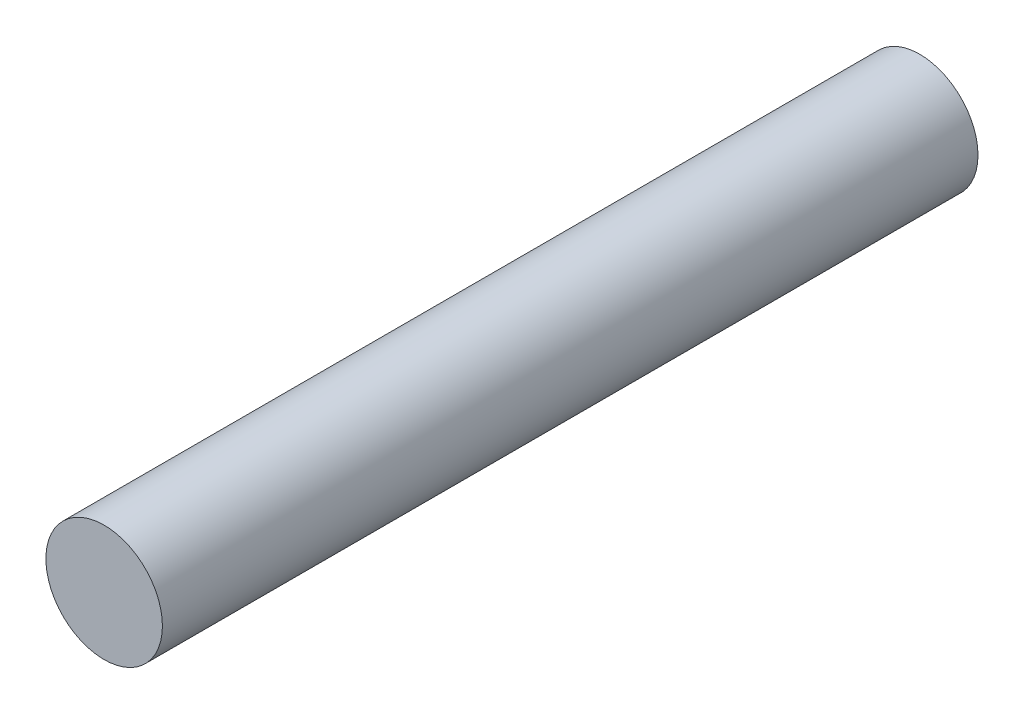
ISO-10303-21;
HEADER;
FILE_DESCRIPTION(('STEP AP214'),'2;1');
FILE_NAME('part.step','',(''),(''),'','','');
FILE_SCHEMA(('AUTOMOTIVE_DESIGN { 1 0 10303 214 1 1 1 1 }'));
ENDSEC;
DATA;
#1=APPLICATION_CONTEXT('core data for automotive mechanical design processes');
#2=APPLICATION_PROTOCOL_DEFINITION('international standard','automotive_design',2000,#1);
#3=PRODUCT_CONTEXT('',#1,'mechanical');
#4=PRODUCT('Part','Part','',(#3));
#5=PRODUCT_RELATED_PRODUCT_CATEGORY('part','',(#4));
#6=PRODUCT_DEFINITION_FORMATION('','',#4);
#7=PRODUCT_DEFINITION_CONTEXT('part definition',#1,'design');
#8=PRODUCT_DEFINITION('design','',#6,#7);
#9=PRODUCT_DEFINITION_SHAPE('','',#8);
#10=(LENGTH_UNIT() NAMED_UNIT(*) SI_UNIT(.MILLI.,.METRE.));
#11=(NAMED_UNIT(*) PLANE_ANGLE_UNIT() SI_UNIT($,.RADIAN.));
#12=(NAMED_UNIT(*) SI_UNIT($,.STERADIAN.) SOLID_ANGLE_UNIT());
#13=UNCERTAINTY_MEASURE_WITH_UNIT(LENGTH_MEASURE(1.E-05),#10,'distance_accuracy_value','');
#14=(GEOMETRIC_REPRESENTATION_CONTEXT(3) GLOBAL_UNCERTAINTY_ASSIGNED_CONTEXT((#13)) GLOBAL_UNIT_ASSIGNED_CONTEXT((#10,
#11,#12)) REPRESENTATION_CONTEXT('',''));
#15=CARTESIAN_POINT('',(0.,0.,0.));
#16=DIRECTION('',(0.,0.,1.));
#17=DIRECTION('',(1.,0.,0.));
#18=AXIS2_PLACEMENT_3D('',#15,#16,#17);
#19=CARTESIAN_POINT('',(0.,0.,35.));
#20=DIRECTION('',(0.,0.,-1.));
#21=DIRECTION('',(-1.,0.,0.));
#22=AXIS2_PLACEMENT_3D('',#19,#20,#21);
#23=CYLINDRICAL_SURFACE('',#22,2.5);
#24=CARTESIAN_POINT('',(0.,0.,35.));
#25=DIRECTION('',(0.,0.,1.));
#26=DIRECTION('',(1.,0.,0.));
#27=AXIS2_PLACEMENT_3D('',#24,#25,#26);
#28=CIRCLE('',#27,2.5);
#29=CARTESIAN_POINT('',(2.5,0.,35.));
#30=VERTEX_POINT('',#29);
#31=EDGE_CURVE('E10',#30,#30,#28,.T.);
#32=ORIENTED_EDGE('',*,*,#31,.F.);
#33=EDGE_LOOP('',(#32));
#34=FACE_BOUND('',#33,.T.);
#35=CARTESIAN_POINT('',(0.,0.,0.));
#36=DIRECTION('',(0.,0.,1.));
#37=DIRECTION('',(1.,0.,0.));
#38=AXIS2_PLACEMENT_3D('',#35,#36,#37);
#39=CIRCLE('',#38,2.5);
#40=CARTESIAN_POINT('',(2.5,0.,0.));
#41=VERTEX_POINT('',#40);
#42=EDGE_CURVE('E34',#41,#41,#39,.T.);
#43=ORIENTED_EDGE('',*,*,#42,.T.);
#44=EDGE_LOOP('',(#43));
#45=FACE_BOUND('',#44,.T.);
#46=ADVANCED_FACE('F31',(#34,#45),#23,.T.);
#47=CARTESIAN_POINT('',(0.,0.,35.));
#48=DIRECTION('',(0.,0.,1.));
#49=DIRECTION('',(1.,0.,0.));
#50=AXIS2_PLACEMENT_3D('',#47,#48,#49);
#51=PLANE('',#50);
#52=ORIENTED_EDGE('',*,*,#31,.T.);
#53=EDGE_LOOP('',(#52));
#54=FACE_BOUND('',#53,.T.);
#55=ADVANCED_FACE('F46',(#54),#51,.T.);
#56=CARTESIAN_POINT('',(0.,0.,0.));
#57=DIRECTION('',(0.,0.,1.));
#58=DIRECTION('',(1.,0.,0.));
#59=AXIS2_PLACEMENT_3D('',#56,#57,#58);
#60=PLANE('',#59);
#61=ORIENTED_EDGE('',*,*,#42,.F.);
#62=EDGE_LOOP('',(#61));
#63=FACE_BOUND('',#62,.T.);
#64=ADVANCED_FACE('F44',(#63),#60,.F.);
#65=CLOSED_SHELL('',(#46,#55,#64));
#66=MANIFOLD_SOLID_BREP('B2',#65);
#67=ADVANCED_BREP_SHAPE_REPRESENTATION('',(#18,#66),#14);
#68=SHAPE_DEFINITION_REPRESENTATION(#9,#67);
ENDSEC;
END-ISO-10303-21;
